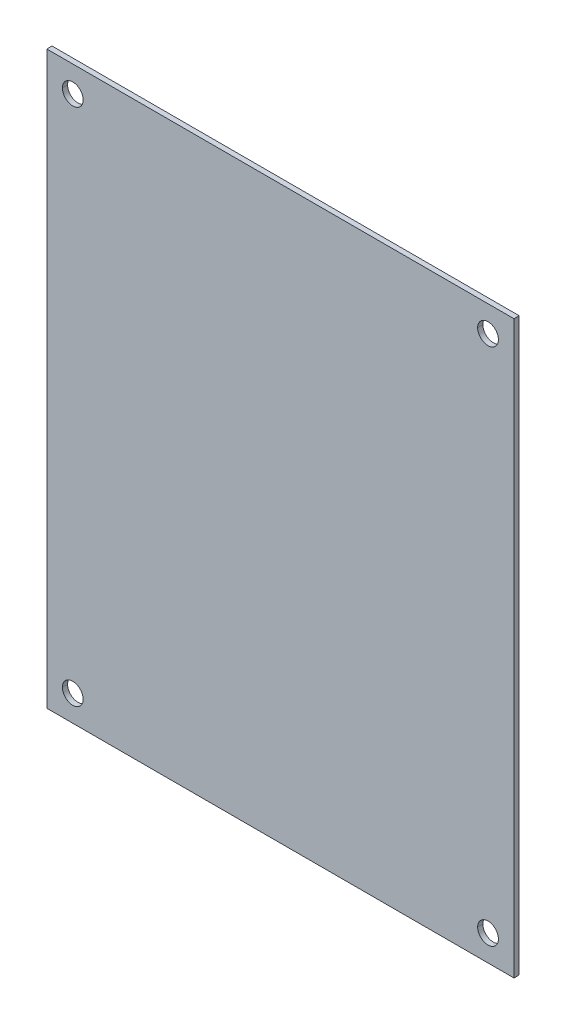
ISO-10303-21;
HEADER;
FILE_DESCRIPTION(('STEP AP214'),'2;1');
FILE_NAME('part.step','',(''),(''),'','','');
FILE_SCHEMA(('AUTOMOTIVE_DESIGN { 1 0 10303 214 1 1 1 1 }'));
ENDSEC;
DATA;
#1=APPLICATION_CONTEXT('core data for automotive mechanical design processes');
#2=APPLICATION_PROTOCOL_DEFINITION('international standard','automotive_design',2000,#1);
#3=PRODUCT_CONTEXT('',#1,'mechanical');
#4=PRODUCT('Part','Part','',(#3));
#5=PRODUCT_RELATED_PRODUCT_CATEGORY('part','',(#4));
#6=PRODUCT_DEFINITION_FORMATION('','',#4);
#7=PRODUCT_DEFINITION_CONTEXT('part definition',#1,'design');
#8=PRODUCT_DEFINITION('design','',#6,#7);
#9=PRODUCT_DEFINITION_SHAPE('','',#8);
#10=(LENGTH_UNIT() NAMED_UNIT(*) SI_UNIT(.MILLI.,.METRE.));
#11=(NAMED_UNIT(*) PLANE_ANGLE_UNIT() SI_UNIT($,.RADIAN.));
#12=(NAMED_UNIT(*) SI_UNIT($,.STERADIAN.) SOLID_ANGLE_UNIT());
#13=UNCERTAINTY_MEASURE_WITH_UNIT(LENGTH_MEASURE(1.E-05),#10,'distance_accuracy_value','');
#14=(GEOMETRIC_REPRESENTATION_CONTEXT(3) GLOBAL_UNCERTAINTY_ASSIGNED_CONTEXT((#13)) GLOBAL_UNIT_ASSIGNED_CONTEXT((#10,
#11,#12)) REPRESENTATION_CONTEXT('',''));
#15=CARTESIAN_POINT('',(0.,0.,0.));
#16=DIRECTION('',(0.,0.,1.));
#17=DIRECTION('',(1.,0.,0.));
#18=AXIS2_PLACEMENT_3D('',#15,#16,#17);
#19=CARTESIAN_POINT('',(40.,-50.,-1.));
#20=DIRECTION('',(0.,0.,1.));
#21=DIRECTION('',(1.,0.,0.));
#22=AXIS2_PLACEMENT_3D('',#19,#20,#21);
#23=CYLINDRICAL_SURFACE('',#22,2.);
#24=DIRECTION('',(0.,0.,1.));
#25=VECTOR('',#24,1.);
#26=CARTESIAN_POINT('',(38.,-50.,-1.));
#27=LINE('',#26,#25);
#28=CARTESIAN_POINT('',(38.,-50.,-1.));
#29=VERTEX_POINT('',#28);
#30=CARTESIAN_POINT('',(38.,-50.,0.));
#31=VERTEX_POINT('',#30);
#32=EDGE_CURVE('E660',#29,#31,#27,.T.);
#33=ORIENTED_EDGE('',*,*,#32,.F.);
#34=CARTESIAN_POINT('',(40.,-50.,-1.));
#35=DIRECTION('',(0.,0.,1.));
#36=DIRECTION('',(1.,0.,0.));
#37=AXIS2_PLACEMENT_3D('',#34,#35,#36);
#38=CIRCLE('',#37,2.);
#39=CARTESIAN_POINT('',(42.,-50.,-1.));
#40=VERTEX_POINT('',#39);
#41=EDGE_CURVE('E200',#40,#29,#38,.T.);
#42=ORIENTED_EDGE('',*,*,#41,.F.);
#43=DIRECTION('',(0.,0.,1.));
#44=VECTOR('',#43,1.);
#45=CARTESIAN_POINT('',(42.,-50.,-1.));
#46=LINE('',#45,#44);
#47=CARTESIAN_POINT('',(42.,-50.,0.));
#48=VERTEX_POINT('',#47);
#49=EDGE_CURVE('E189',#40,#48,#46,.T.);
#50=ORIENTED_EDGE('',*,*,#49,.T.);
#51=CARTESIAN_POINT('',(40.,-50.,0.));
#52=DIRECTION('',(0.,0.,1.));
#53=DIRECTION('',(1.,0.,0.));
#54=AXIS2_PLACEMENT_3D('',#51,#52,#53);
#55=CIRCLE('',#54,2.);
#56=EDGE_CURVE('E216',#48,#31,#55,.T.);
#57=ORIENTED_EDGE('',*,*,#56,.T.);
#58=EDGE_LOOP('',(#33,#42,#50,#57));
#59=FACE_BOUND('',#58,.T.);
#60=ADVANCED_FACE('F16',(#59),#23,.F.);
#61=CARTESIAN_POINT('',(-40.,-50.,-1.));
#62=DIRECTION('',(0.,0.,1.));
#63=DIRECTION('',(1.,0.,0.));
#64=AXIS2_PLACEMENT_3D('',#61,#62,#63);
#65=CYLINDRICAL_SURFACE('',#64,2.);
#66=DIRECTION('',(0.,0.,1.));
#67=VECTOR('',#66,1.);
#68=CARTESIAN_POINT('',(-42.,-50.,-1.));
#69=LINE('',#68,#67);
#70=CARTESIAN_POINT('',(-42.,-50.,-1.));
#71=VERTEX_POINT('',#70);
#72=CARTESIAN_POINT('',(-42.,-50.,0.));
#73=VERTEX_POINT('',#72);
#74=EDGE_CURVE('E188',#71,#73,#69,.T.);
#75=ORIENTED_EDGE('',*,*,#74,.F.);
#76=CARTESIAN_POINT('',(-40.,-50.,-1.));
#77=DIRECTION('',(0.,0.,1.));
#78=DIRECTION('',(1.,0.,0.));
#79=AXIS2_PLACEMENT_3D('',#76,#77,#78);
#80=CIRCLE('',#79,2.);
#81=CARTESIAN_POINT('',(-38.,-50.,-1.));
#82=VERTEX_POINT('',#81);
#83=EDGE_CURVE('E207',#82,#71,#80,.T.);
#84=ORIENTED_EDGE('',*,*,#83,.F.);
#85=DIRECTION('',(0.,0.,1.));
#86=VECTOR('',#85,1.);
#87=CARTESIAN_POINT('',(-38.,-50.,-1.));
#88=LINE('',#87,#86);
#89=CARTESIAN_POINT('',(-38.,-50.,0.));
#90=VERTEX_POINT('',#89);
#91=EDGE_CURVE('E195',#82,#90,#88,.T.);
#92=ORIENTED_EDGE('',*,*,#91,.T.);
#93=CARTESIAN_POINT('',(-40.,-50.,0.));
#94=DIRECTION('',(0.,0.,1.));
#95=DIRECTION('',(1.,0.,0.));
#96=AXIS2_PLACEMENT_3D('',#93,#94,#95);
#97=CIRCLE('',#96,2.);
#98=EDGE_CURVE('E183',#90,#73,#97,.T.);
#99=ORIENTED_EDGE('',*,*,#98,.T.);
#100=EDGE_LOOP('',(#75,#84,#92,#99));
#101=FACE_BOUND('',#100,.T.);
#102=ADVANCED_FACE('F278',(#101),#65,.F.);
#103=CARTESIAN_POINT('',(40.,50.,-1.));
#104=DIRECTION('',(0.,0.,1.));
#105=DIRECTION('',(1.,0.,0.));
#106=AXIS2_PLACEMENT_3D('',#103,#104,#105);
#107=CYLINDRICAL_SURFACE('',#106,2.);
#108=DIRECTION('',(0.,0.,1.));
#109=VECTOR('',#108,1.);
#110=CARTESIAN_POINT('',(38.,50.,-1.));
#111=LINE('',#110,#109);
#112=CARTESIAN_POINT('',(38.,50.,-1.));
#113=VERTEX_POINT('',#112);
#114=CARTESIAN_POINT('',(38.,50.,0.));
#115=VERTEX_POINT('',#114);
#116=EDGE_CURVE('E194',#113,#115,#111,.T.);
#117=ORIENTED_EDGE('',*,*,#116,.F.);
#118=CARTESIAN_POINT('',(40.,50.,-1.));
#119=DIRECTION('',(0.,0.,1.));
#120=DIRECTION('',(1.,0.,0.));
#121=AXIS2_PLACEMENT_3D('',#118,#119,#120);
#122=CIRCLE('',#121,2.);
#123=CARTESIAN_POINT('',(42.,50.,-1.));
#124=VERTEX_POINT('',#123);
#125=EDGE_CURVE('E204',#124,#113,#122,.T.);
#126=ORIENTED_EDGE('',*,*,#125,.F.);
#127=DIRECTION('',(0.,0.,1.));
#128=VECTOR('',#127,1.);
#129=CARTESIAN_POINT('',(42.,50.,-1.));
#130=LINE('',#129,#128);
#131=CARTESIAN_POINT('',(42.,50.,0.));
#132=VERTEX_POINT('',#131);
#133=EDGE_CURVE('E242',#124,#132,#130,.T.);
#134=ORIENTED_EDGE('',*,*,#133,.T.);
#135=CARTESIAN_POINT('',(40.,50.,0.));
#136=DIRECTION('',(0.,0.,1.));
#137=DIRECTION('',(1.,0.,0.));
#138=AXIS2_PLACEMENT_3D('',#135,#136,#137);
#139=CIRCLE('',#138,2.);
#140=EDGE_CURVE('E27',#132,#115,#139,.T.);
#141=ORIENTED_EDGE('',*,*,#140,.T.);
#142=EDGE_LOOP('',(#117,#126,#134,#141));
#143=FACE_BOUND('',#142,.T.);
#144=ADVANCED_FACE('F308',(#143),#107,.F.);
#145=CARTESIAN_POINT('',(-40.,50.,-1.));
#146=DIRECTION('',(0.,0.,1.));
#147=DIRECTION('',(1.,0.,0.));
#148=AXIS2_PLACEMENT_3D('',#145,#146,#147);
#149=CYLINDRICAL_SURFACE('',#148,2.);
#150=DIRECTION('',(0.,0.,1.));
#151=VECTOR('',#150,1.);
#152=CARTESIAN_POINT('',(-42.,50.,-1.));
#153=LINE('',#152,#151);
#154=CARTESIAN_POINT('',(-42.,50.,-1.));
#155=VERTEX_POINT('',#154);
#156=CARTESIAN_POINT('',(-42.,50.,0.));
#157=VERTEX_POINT('',#156);
#158=EDGE_CURVE('E233',#155,#157,#153,.T.);
#159=ORIENTED_EDGE('',*,*,#158,.F.);
#160=CARTESIAN_POINT('',(-40.,50.,-1.));
#161=DIRECTION('',(0.,0.,1.));
#162=DIRECTION('',(1.,0.,0.));
#163=AXIS2_PLACEMENT_3D('',#160,#161,#162);
#164=CIRCLE('',#163,2.);
#165=CARTESIAN_POINT('',(-38.,50.,-1.));
#166=VERTEX_POINT('',#165);
#167=EDGE_CURVE('E20',#166,#155,#164,.T.);
#168=ORIENTED_EDGE('',*,*,#167,.F.);
#169=DIRECTION('',(0.,0.,1.));
#170=VECTOR('',#169,1.);
#171=CARTESIAN_POINT('',(-38.,50.,-1.));
#172=LINE('',#171,#170);
#173=CARTESIAN_POINT('',(-38.,50.,0.));
#174=VERTEX_POINT('',#173);
#175=EDGE_CURVE('E167',#166,#174,#172,.T.);
#176=ORIENTED_EDGE('',*,*,#175,.T.);
#177=CARTESIAN_POINT('',(-40.,50.,0.));
#178=DIRECTION('',(0.,0.,1.));
#179=DIRECTION('',(1.,0.,0.));
#180=AXIS2_PLACEMENT_3D('',#177,#178,#179);
#181=CIRCLE('',#180,2.);
#182=EDGE_CURVE('E11',#174,#157,#181,.T.);
#183=ORIENTED_EDGE('',*,*,#182,.T.);
#184=EDGE_LOOP('',(#159,#168,#176,#183));
#185=FACE_BOUND('',#184,.T.);
#186=ADVANCED_FACE('F315',(#185),#149,.F.);
#187=CARTESIAN_POINT('',(0.,0.,0.));
#188=DIRECTION('',(0.,0.,-1.));
#189=DIRECTION('',(0.,-1.,0.));
#190=AXIS2_PLACEMENT_3D('',#187,#188,#189);
#191=PLANE('',#190);
#192=ORIENTED_EDGE('',*,*,#182,.F.);
#193=CARTESIAN_POINT('',(-40.,50.,0.));
#194=DIRECTION('',(0.,0.,1.));
#195=DIRECTION('',(1.,0.,0.));
#196=AXIS2_PLACEMENT_3D('',#193,#194,#195);
#197=CIRCLE('',#196,2.);
#198=EDGE_CURVE('E175',#157,#174,#197,.T.);
#199=ORIENTED_EDGE('',*,*,#198,.F.);
#200=EDGE_LOOP('',(#192,#199));
#201=FACE_BOUND('',#200,.T.);
#202=ORIENTED_EDGE('',*,*,#140,.F.);
#203=CARTESIAN_POINT('',(40.,50.,0.));
#204=DIRECTION('',(0.,0.,1.));
#205=DIRECTION('',(1.,0.,0.));
#206=AXIS2_PLACEMENT_3D('',#203,#204,#205);
#207=CIRCLE('',#206,2.);
#208=EDGE_CURVE('E211',#115,#132,#207,.T.);
#209=ORIENTED_EDGE('',*,*,#208,.F.);
#210=EDGE_LOOP('',(#202,#209));
#211=FACE_BOUND('',#210,.T.);
#212=ORIENTED_EDGE('',*,*,#98,.F.);
#213=CARTESIAN_POINT('',(-40.,-50.,0.));
#214=DIRECTION('',(0.,0.,1.));
#215=DIRECTION('',(1.,0.,0.));
#216=AXIS2_PLACEMENT_3D('',#213,#214,#215);
#217=CIRCLE('',#216,2.);
#218=EDGE_CURVE('E214',#73,#90,#217,.T.);
#219=ORIENTED_EDGE('',*,*,#218,.F.);
#220=EDGE_LOOP('',(#212,#219));
#221=FACE_BOUND('',#220,.T.);
#222=ORIENTED_EDGE('',*,*,#56,.F.);
#223=CARTESIAN_POINT('',(40.,-50.,0.));
#224=DIRECTION('',(0.,0.,1.));
#225=DIRECTION('',(1.,0.,0.));
#226=AXIS2_PLACEMENT_3D('',#223,#224,#225);
#227=CIRCLE('',#226,2.);
#228=EDGE_CURVE('E239',#31,#48,#227,.T.);
#229=ORIENTED_EDGE('',*,*,#228,.F.);
#230=EDGE_LOOP('',(#222,#229));
#231=FACE_BOUND('',#230,.T.);
#232=DIRECTION('',(0.,1.,0.));
#233=VECTOR('',#232,1.);
#234=CARTESIAN_POINT('',(45.,-55.,0.));
#235=LINE('',#234,#233);
#236=CARTESIAN_POINT('',(45.,-55.,0.));
#237=VERTEX_POINT('',#236);
#238=CARTESIAN_POINT('',(45.,55.,0.));
#239=VERTEX_POINT('',#238);
#240=EDGE_CURVE('E156',#237,#239,#235,.T.);
#241=ORIENTED_EDGE('',*,*,#240,.T.);
#242=DIRECTION('',(-1.,0.,0.));
#243=VECTOR('',#242,1.);
#244=CARTESIAN_POINT('',(-45.,55.,0.));
#245=LINE('',#244,#243);
#246=CARTESIAN_POINT('',(-45.,55.,0.));
#247=VERTEX_POINT('',#246);
#248=EDGE_CURVE('E139',#239,#247,#245,.T.);
#249=ORIENTED_EDGE('',*,*,#248,.T.);
#250=DIRECTION('',(0.,-1.,0.));
#251=VECTOR('',#250,1.);
#252=CARTESIAN_POINT('',(-45.,-55.,0.));
#253=LINE('',#252,#251);
#254=CARTESIAN_POINT('',(-45.,-55.,0.));
#255=VERTEX_POINT('',#254);
#256=EDGE_CURVE('E203',#247,#255,#253,.T.);
#257=ORIENTED_EDGE('',*,*,#256,.T.);
#258=DIRECTION('',(1.,0.,0.));
#259=VECTOR('',#258,1.);
#260=CARTESIAN_POINT('',(-45.,-55.,0.));
#261=LINE('',#260,#259);
#262=EDGE_CURVE('E160',#255,#237,#261,.T.);
#263=ORIENTED_EDGE('',*,*,#262,.T.);
#264=EDGE_LOOP('',(#241,#249,#257,#263));
#265=FACE_BOUND('',#264,.T.);
#266=ADVANCED_FACE('F162',(#201,#211,#221,#231,#265),#191,.F.);
#267=CARTESIAN_POINT('',(0.,0.,-1.));
#268=DIRECTION('',(0.,0.,-1.));
#269=DIRECTION('',(0.,-1.,0.));
#270=AXIS2_PLACEMENT_3D('',#267,#268,#269);
#271=PLANE('',#270);
#272=ORIENTED_EDGE('',*,*,#167,.T.);
#273=CARTESIAN_POINT('',(-40.,50.,-1.));
#274=DIRECTION('',(0.,0.,1.));
#275=DIRECTION('',(1.,0.,0.));
#276=AXIS2_PLACEMENT_3D('',#273,#274,#275);
#277=CIRCLE('',#276,2.);
#278=EDGE_CURVE('E179',#155,#166,#277,.T.);
#279=ORIENTED_EDGE('',*,*,#278,.T.);
#280=EDGE_LOOP('',(#272,#279));
#281=FACE_BOUND('',#280,.T.);
#282=ORIENTED_EDGE('',*,*,#125,.T.);
#283=CARTESIAN_POINT('',(40.,50.,-1.));
#284=DIRECTION('',(0.,0.,1.));
#285=DIRECTION('',(1.,0.,0.));
#286=AXIS2_PLACEMENT_3D('',#283,#284,#285);
#287=CIRCLE('',#286,2.);
#288=EDGE_CURVE('E190',#113,#124,#287,.T.);
#289=ORIENTED_EDGE('',*,*,#288,.T.);
#290=EDGE_LOOP('',(#282,#289));
#291=FACE_BOUND('',#290,.T.);
#292=ORIENTED_EDGE('',*,*,#83,.T.);
#293=CARTESIAN_POINT('',(-40.,-50.,-1.));
#294=DIRECTION('',(0.,0.,1.));
#295=DIRECTION('',(1.,0.,0.));
#296=AXIS2_PLACEMENT_3D('',#293,#294,#295);
#297=CIRCLE('',#296,2.);
#298=EDGE_CURVE('E184',#71,#82,#297,.T.);
#299=ORIENTED_EDGE('',*,*,#298,.T.);
#300=EDGE_LOOP('',(#292,#299));
#301=FACE_BOUND('',#300,.T.);
#302=ORIENTED_EDGE('',*,*,#41,.T.);
#303=CARTESIAN_POINT('',(40.,-50.,-1.));
#304=DIRECTION('',(0.,0.,1.));
#305=DIRECTION('',(1.,0.,0.));
#306=AXIS2_PLACEMENT_3D('',#303,#304,#305);
#307=CIRCLE('',#306,2.);
#308=EDGE_CURVE('E669',#29,#40,#307,.T.);
#309=ORIENTED_EDGE('',*,*,#308,.T.);
#310=EDGE_LOOP('',(#302,#309));
#311=FACE_BOUND('',#310,.T.);
#312=DIRECTION('',(0.,1.,0.));
#313=VECTOR('',#312,1.);
#314=CARTESIAN_POINT('',(45.,-55.,-1.));
#315=LINE('',#314,#313);
#316=CARTESIAN_POINT('',(45.,-55.,-1.));
#317=VERTEX_POINT('',#316);
#318=CARTESIAN_POINT('',(45.,55.,-1.));
#319=VERTEX_POINT('',#318);
#320=EDGE_CURVE('E158',#317,#319,#315,.T.);
#321=ORIENTED_EDGE('',*,*,#320,.F.);
#322=DIRECTION('',(1.,0.,0.));
#323=VECTOR('',#322,1.);
#324=CARTESIAN_POINT('',(-45.,-55.,-1.));
#325=LINE('',#324,#323);
#326=CARTESIAN_POINT('',(-45.,-55.,-1.));
#327=VERTEX_POINT('',#326);
#328=EDGE_CURVE('E253',#327,#317,#325,.T.);
#329=ORIENTED_EDGE('',*,*,#328,.F.);
#330=DIRECTION('',(0.,-1.,0.));
#331=VECTOR('',#330,1.);
#332=CARTESIAN_POINT('',(-45.,-55.,-1.));
#333=LINE('',#332,#331);
#334=CARTESIAN_POINT('',(-45.,55.,-1.));
#335=VERTEX_POINT('',#334);
#336=EDGE_CURVE('E150',#335,#327,#333,.T.);
#337=ORIENTED_EDGE('',*,*,#336,.F.);
#338=DIRECTION('',(-1.,0.,0.));
#339=VECTOR('',#338,1.);
#340=CARTESIAN_POINT('',(-45.,55.,-1.));
#341=LINE('',#340,#339);
#342=EDGE_CURVE('E42',#319,#335,#341,.T.);
#343=ORIENTED_EDGE('',*,*,#342,.F.);
#344=EDGE_LOOP('',(#321,#329,#337,#343));
#345=FACE_BOUND('',#344,.T.);
#346=ADVANCED_FACE('F280',(#281,#291,#301,#311,#345),#271,.T.);
#347=CARTESIAN_POINT('',(-45.,55.,-1.));
#348=DIRECTION('',(0.,1.,0.));
#349=DIRECTION('',(1.,0.,0.));
#350=AXIS2_PLACEMENT_3D('',#347,#348,#349);
#351=PLANE('',#350);
#352=ORIENTED_EDGE('',*,*,#248,.F.);
#353=DIRECTION('',(0.,0.,1.));
#354=VECTOR('',#353,1.);
#355=CARTESIAN_POINT('',(45.,55.,-1.));
#356=LINE('',#355,#354);
#357=EDGE_CURVE('E142',#319,#239,#356,.T.);
#358=ORIENTED_EDGE('',*,*,#357,.F.);
#359=ORIENTED_EDGE('',*,*,#342,.T.);
#360=DIRECTION('',(0.,0.,1.));
#361=VECTOR('',#360,1.);
#362=CARTESIAN_POINT('',(-45.,55.,-1.));
#363=LINE('',#362,#361);
#364=EDGE_CURVE('E145',#335,#247,#363,.T.);
#365=ORIENTED_EDGE('',*,*,#364,.T.);
#366=EDGE_LOOP('',(#352,#358,#359,#365));
#367=FACE_BOUND('',#366,.T.);
#368=ADVANCED_FACE('F141',(#367),#351,.T.);
#369=CARTESIAN_POINT('',(-45.,-55.,-1.));
#370=DIRECTION('',(-1.,0.,0.));
#371=DIRECTION('',(0.,0.,1.));
#372=AXIS2_PLACEMENT_3D('',#369,#370,#371);
#373=PLANE('',#372);
#374=ORIENTED_EDGE('',*,*,#256,.F.);
#375=ORIENTED_EDGE('',*,*,#364,.F.);
#376=ORIENTED_EDGE('',*,*,#336,.T.);
#377=DIRECTION('',(0.,0.,1.));
#378=VECTOR('',#377,1.);
#379=CARTESIAN_POINT('',(-45.,-55.,-1.));
#380=LINE('',#379,#378);
#381=EDGE_CURVE('E249',#327,#255,#380,.T.);
#382=ORIENTED_EDGE('',*,*,#381,.T.);
#383=EDGE_LOOP('',(#374,#375,#376,#382));
#384=FACE_BOUND('',#383,.T.);
#385=ADVANCED_FACE('F292',(#384),#373,.T.);
#386=CARTESIAN_POINT('',(-45.,-55.,-1.));
#387=DIRECTION('',(0.,-1.,0.));
#388=DIRECTION('',(0.,0.,-1.));
#389=AXIS2_PLACEMENT_3D('',#386,#387,#388);
#390=PLANE('',#389);
#391=ORIENTED_EDGE('',*,*,#262,.F.);
#392=ORIENTED_EDGE('',*,*,#381,.F.);
#393=ORIENTED_EDGE('',*,*,#328,.T.);
#394=DIRECTION('',(0.,0.,1.));
#395=VECTOR('',#394,1.);
#396=CARTESIAN_POINT('',(45.,-55.,-1.));
#397=LINE('',#396,#395);
#398=EDGE_CURVE('E166',#317,#237,#397,.T.);
#399=ORIENTED_EDGE('',*,*,#398,.T.);
#400=EDGE_LOOP('',(#391,#392,#393,#399));
#401=FACE_BOUND('',#400,.T.);
#402=ADVANCED_FACE('F290',(#401),#390,.T.);
#403=CARTESIAN_POINT('',(45.,-55.,-1.));
#404=DIRECTION('',(1.,0.,0.));
#405=DIRECTION('',(0.,1.,0.));
#406=AXIS2_PLACEMENT_3D('',#403,#404,#405);
#407=PLANE('',#406);
#408=ORIENTED_EDGE('',*,*,#240,.F.);
#409=ORIENTED_EDGE('',*,*,#398,.F.);
#410=ORIENTED_EDGE('',*,*,#320,.T.);
#411=ORIENTED_EDGE('',*,*,#357,.T.);
#412=EDGE_LOOP('',(#408,#409,#410,#411));
#413=FACE_BOUND('',#412,.T.);
#414=ADVANCED_FACE('F154',(#413),#407,.T.);
#415=CARTESIAN_POINT('',(-40.,50.,-1.));
#416=DIRECTION('',(0.,0.,1.));
#417=DIRECTION('',(1.,0.,0.));
#418=AXIS2_PLACEMENT_3D('',#415,#416,#417);
#419=CYLINDRICAL_SURFACE('',#418,2.);
#420=ORIENTED_EDGE('',*,*,#278,.F.);
#421=ORIENTED_EDGE('',*,*,#158,.T.);
#422=ORIENTED_EDGE('',*,*,#198,.T.);
#423=ORIENTED_EDGE('',*,*,#175,.F.);
#424=EDGE_LOOP('',(#420,#421,#422,#423));
#425=FACE_BOUND('',#424,.T.);
#426=ADVANCED_FACE('F319',(#425),#419,.F.);
#427=CARTESIAN_POINT('',(40.,50.,-1.));
#428=DIRECTION('',(0.,0.,1.));
#429=DIRECTION('',(1.,0.,0.));
#430=AXIS2_PLACEMENT_3D('',#427,#428,#429);
#431=CYLINDRICAL_SURFACE('',#430,2.);
#432=ORIENTED_EDGE('',*,*,#288,.F.);
#433=ORIENTED_EDGE('',*,*,#116,.T.);
#434=ORIENTED_EDGE('',*,*,#208,.T.);
#435=ORIENTED_EDGE('',*,*,#133,.F.);
#436=EDGE_LOOP('',(#432,#433,#434,#435));
#437=FACE_BOUND('',#436,.T.);
#438=ADVANCED_FACE('F18',(#437),#431,.F.);
#439=CARTESIAN_POINT('',(-40.,-50.,-1.));
#440=DIRECTION('',(0.,0.,1.));
#441=DIRECTION('',(1.,0.,0.));
#442=AXIS2_PLACEMENT_3D('',#439,#440,#441);
#443=CYLINDRICAL_SURFACE('',#442,2.);
#444=ORIENTED_EDGE('',*,*,#298,.F.);
#445=ORIENTED_EDGE('',*,*,#74,.T.);
#446=ORIENTED_EDGE('',*,*,#218,.T.);
#447=ORIENTED_EDGE('',*,*,#91,.F.);
#448=EDGE_LOOP('',(#444,#445,#446,#447));
#449=FACE_BOUND('',#448,.T.);
#450=ADVANCED_FACE('F275',(#449),#443,.F.);
#451=CARTESIAN_POINT('',(40.,-50.,-1.));
#452=DIRECTION('',(0.,0.,1.));
#453=DIRECTION('',(1.,0.,0.));
#454=AXIS2_PLACEMENT_3D('',#451,#452,#453);
#455=CYLINDRICAL_SURFACE('',#454,2.);
#456=ORIENTED_EDGE('',*,*,#308,.F.);
#457=ORIENTED_EDGE('',*,*,#32,.T.);
#458=ORIENTED_EDGE('',*,*,#228,.T.);
#459=ORIENTED_EDGE('',*,*,#49,.F.);
#460=EDGE_LOOP('',(#456,#457,#458,#459));
#461=FACE_BOUND('',#460,.T.);
#462=ADVANCED_FACE('F312',(#461),#455,.F.);
#463=CLOSED_SHELL('',(#60,#102,#144,#186,#266,#346,#368,#385,#402,#414,#426,#438,#450,#462));
#464=MANIFOLD_SOLID_BREP('B1',#463);
#465=ADVANCED_BREP_SHAPE_REPRESENTATION('',(#18,#464),#14);
#466=SHAPE_DEFINITION_REPRESENTATION(#9,#465);
ENDSEC;
END-ISO-10303-21;
